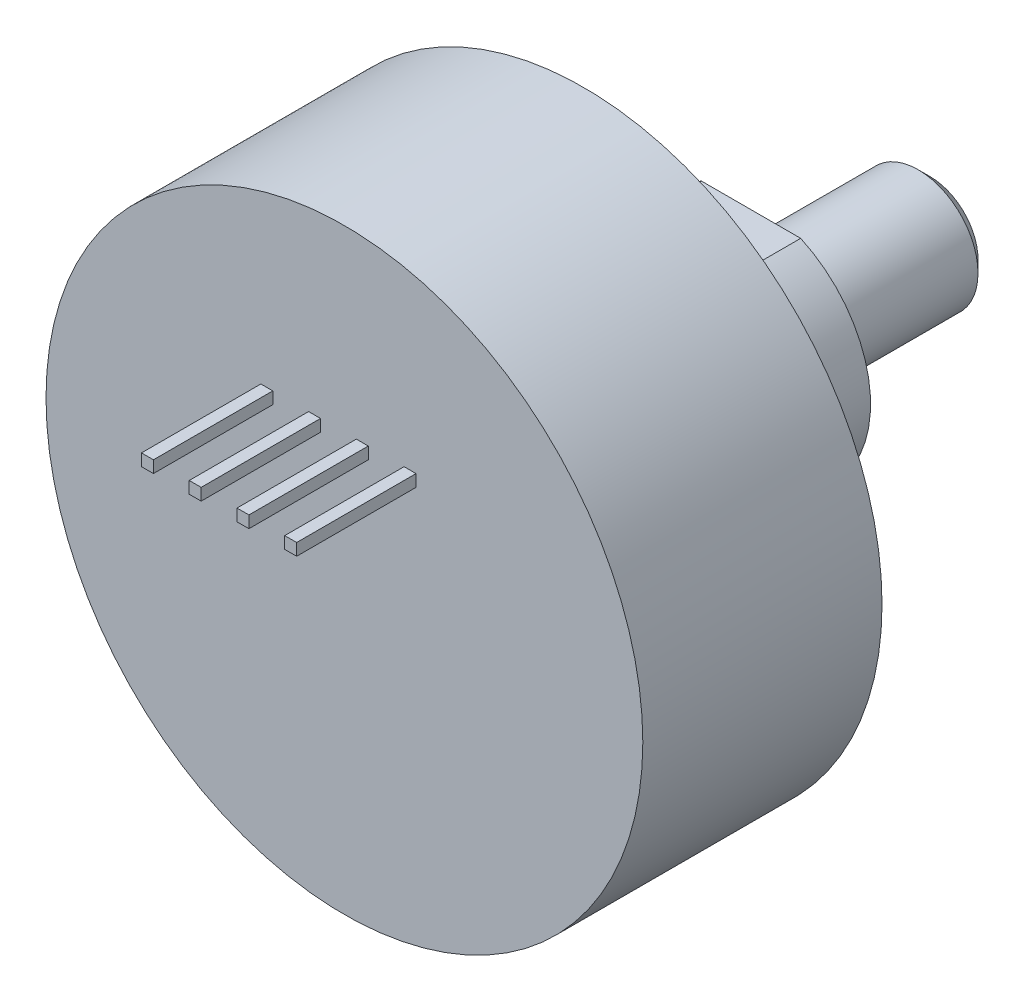
ISO-10303-21;
HEADER;
FILE_DESCRIPTION(('STEP AP214'),'2;1');
FILE_NAME('part.step','',(''),(''),'','','');
FILE_SCHEMA(('AUTOMOTIVE_DESIGN { 1 0 10303 214 1 1 1 1 }'));
ENDSEC;
DATA;
#1=APPLICATION_CONTEXT('core data for automotive mechanical design processes');
#2=APPLICATION_PROTOCOL_DEFINITION('international standard','automotive_design',2000,#1);
#3=PRODUCT_CONTEXT('',#1,'mechanical');
#4=PRODUCT('Part','Part','',(#3));
#5=PRODUCT_RELATED_PRODUCT_CATEGORY('part','',(#4));
#6=PRODUCT_DEFINITION_FORMATION('','',#4);
#7=PRODUCT_DEFINITION_CONTEXT('part definition',#1,'design');
#8=PRODUCT_DEFINITION('design','',#6,#7);
#9=PRODUCT_DEFINITION_SHAPE('','',#8);
#10=(LENGTH_UNIT() NAMED_UNIT(*) SI_UNIT(.MILLI.,.METRE.));
#11=(NAMED_UNIT(*) PLANE_ANGLE_UNIT() SI_UNIT($,.RADIAN.));
#12=(NAMED_UNIT(*) SI_UNIT($,.STERADIAN.) SOLID_ANGLE_UNIT());
#13=UNCERTAINTY_MEASURE_WITH_UNIT(LENGTH_MEASURE(1.E-05),#10,'distance_accuracy_value','');
#14=(GEOMETRIC_REPRESENTATION_CONTEXT(3) GLOBAL_UNCERTAINTY_ASSIGNED_CONTEXT((#13)) GLOBAL_UNIT_ASSIGNED_CONTEXT((#10,
#11,#12)) REPRESENTATION_CONTEXT('',''));
#15=CARTESIAN_POINT('',(0.,0.,0.));
#16=DIRECTION('',(0.,0.,1.));
#17=DIRECTION('',(1.,0.,0.));
#18=AXIS2_PLACEMENT_3D('',#15,#16,#17);
#19=CARTESIAN_POINT('',(-0.635,0.,-6.3881));
#20=DIRECTION('',(0.,0.,1.));
#21=DIRECTION('',(1.,0.,0.));
#22=AXIS2_PLACEMENT_3D('',#19,#20,#21);
#23=PLANE('',#22);
#24=CARTESIAN_POINT('',(0.,0.,-6.3881));
#25=DIRECTION('',(0.,0.,-1.));
#26=DIRECTION('',(-1.,0.,0.));
#27=AXIS2_PLACEMENT_3D('',#24,#25,#26);
#28=CIRCLE('',#27,6.985);
#29=CARTESIAN_POINT('',(-6.985,0.,-6.3881));
#30=VERTEX_POINT('',#29);
#31=EDGE_CURVE('E356',#30,#30,#28,.F.);
#32=ORIENTED_EDGE('',*,*,#31,.F.);
#33=EDGE_LOOP('',(#32));
#34=FACE_BOUND('',#33,.T.);
#35=CARTESIAN_POINT('',(0.,0.,-6.3881));
#36=DIRECTION('',(0.,0.,-1.));
#37=DIRECTION('',(-1.,0.,0.));
#38=AXIS2_PLACEMENT_3D('',#35,#36,#37);
#39=CIRCLE('',#38,6.35);
#40=CARTESIAN_POINT('',(2.63276238008674,5.7785,-6.3881));
#41=VERTEX_POINT('',#40);
#42=CARTESIAN_POINT('',(2.63276238008674,-5.7785,-6.3881));
#43=VERTEX_POINT('',#42);
#44=EDGE_CURVE('E216',#41,#43,#39,.T.);
#45=ORIENTED_EDGE('',*,*,#44,.F.);
#46=DIRECTION('',(1.,0.,0.));
#47=VECTOR('',#46,1.);
#48=CARTESIAN_POINT('',(2.63276238008674,5.7785,-6.3881));
#49=LINE('',#48,#47);
#50=CARTESIAN_POINT('',(-2.63276238008674,5.7785,-6.3881));
#51=VERTEX_POINT('',#50);
#52=EDGE_CURVE('E213',#51,#41,#49,.T.);
#53=ORIENTED_EDGE('',*,*,#52,.F.);
#54=CARTESIAN_POINT('',(0.,0.,-6.3881));
#55=DIRECTION('',(0.,0.,-1.));
#56=DIRECTION('',(1.,0.,0.));
#57=AXIS2_PLACEMENT_3D('',#54,#55,#56);
#58=CIRCLE('',#57,6.35);
#59=CARTESIAN_POINT('',(-2.63276238008674,-5.7785,-6.3881));
#60=VERTEX_POINT('',#59);
#61=EDGE_CURVE('E61',#60,#51,#58,.T.);
#62=ORIENTED_EDGE('',*,*,#61,.F.);
#63=DIRECTION('',(-1.,0.,0.));
#64=VECTOR('',#63,1.);
#65=CARTESIAN_POINT('',(2.63276238008674,-5.7785,-6.3881));
#66=LINE('',#65,#64);
#67=EDGE_CURVE('E56',#43,#60,#66,.T.);
#68=ORIENTED_EDGE('',*,*,#67,.F.);
#69=EDGE_LOOP('',(#45,#53,#62,#68));
#70=FACE_BOUND('',#69,.T.);
#71=ADVANCED_FACE('F34',(#34,#70),#23,.F.);
#72=CARTESIAN_POINT('',(0.,0.,-6.3627));
#73=DIRECTION('',(0.,0.,-1.));
#74=DIRECTION('',(-1.,0.,0.));
#75=AXIS2_PLACEMENT_3D('',#72,#73,#74);
#76=CYLINDRICAL_SURFACE('',#75,6.985);
#77=CARTESIAN_POINT('',(0.,0.,-6.3627));
#78=DIRECTION('',(0.,0.,-1.));
#79=DIRECTION('',(-1.,0.,0.));
#80=AXIS2_PLACEMENT_3D('',#77,#78,#79);
#81=CIRCLE('',#80,6.985);
#82=CARTESIAN_POINT('',(-6.985,0.,-6.3627));
#83=VERTEX_POINT('',#82);
#84=EDGE_CURVE('E347',#83,#83,#81,.T.);
#85=ORIENTED_EDGE('',*,*,#84,.T.);
#86=EDGE_LOOP('',(#85));
#87=FACE_BOUND('',#86,.T.);
#88=ORIENTED_EDGE('',*,*,#31,.T.);
#89=EDGE_LOOP('',(#88));
#90=FACE_BOUND('',#89,.T.);
#91=ADVANCED_FACE('F411',(#87,#90),#76,.T.);
#92=CARTESIAN_POINT('',(3.81,5.715,6.3627));
#93=DIRECTION('',(0.,-1.,0.));
#94=DIRECTION('',(0.,0.,-1.));
#95=AXIS2_PLACEMENT_3D('',#92,#93,#94);
#96=PLANE('',#95);
#97=DIRECTION('',(1.,0.,0.));
#98=VECTOR('',#97,1.);
#99=CARTESIAN_POINT('',(3.81,5.715,6.3627));
#100=LINE('',#99,#98);
#101=CARTESIAN_POINT('',(3.175,5.715,6.3627));
#102=VERTEX_POINT('',#101);
#103=CARTESIAN_POINT('',(3.81,5.715,6.3627));
#104=VERTEX_POINT('',#103);
#105=EDGE_CURVE('E354',#102,#104,#100,.T.);
#106=ORIENTED_EDGE('',*,*,#105,.T.);
#107=DIRECTION('',(0.,0.,-1.));
#108=VECTOR('',#107,1.);
#109=CARTESIAN_POINT('',(3.81,5.715,6.3627));
#110=LINE('',#109,#108);
#111=CARTESIAN_POINT('',(3.81,5.715,12.7127));
#112=VERTEX_POINT('',#111);
#113=EDGE_CURVE('E339',#112,#104,#110,.T.);
#114=ORIENTED_EDGE('',*,*,#113,.F.);
#115=DIRECTION('',(1.,0.,0.));
#116=VECTOR('',#115,1.);
#117=CARTESIAN_POINT('',(3.4925,5.715,12.7127));
#118=LINE('',#117,#116);
#119=CARTESIAN_POINT('',(3.175,5.715,12.7127));
#120=VERTEX_POINT('',#119);
#121=EDGE_CURVE('E345',#120,#112,#118,.T.);
#122=ORIENTED_EDGE('',*,*,#121,.F.);
#123=DIRECTION('',(0.,0.,1.));
#124=VECTOR('',#123,1.);
#125=CARTESIAN_POINT('',(3.175,5.715,6.3627));
#126=LINE('',#125,#124);
#127=EDGE_CURVE('E328',#102,#120,#126,.T.);
#128=ORIENTED_EDGE('',*,*,#127,.F.);
#129=EDGE_LOOP('',(#106,#114,#122,#128));
#130=FACE_BOUND('',#129,.T.);
#131=ADVANCED_FACE('F416',(#130),#96,.T.);
#132=CARTESIAN_POINT('',(1.27,5.715,6.3627));
#133=DIRECTION('',(0.,-1.,0.));
#134=DIRECTION('',(0.,0.,-1.));
#135=AXIS2_PLACEMENT_3D('',#132,#133,#134);
#136=PLANE('',#135);
#137=DIRECTION('',(1.,0.,0.));
#138=VECTOR('',#137,1.);
#139=CARTESIAN_POINT('',(1.27,5.715,6.3627));
#140=LINE('',#139,#138);
#141=CARTESIAN_POINT('',(0.635,5.715,6.3627));
#142=VERTEX_POINT('',#141);
#143=CARTESIAN_POINT('',(1.27,5.715,6.3627));
#144=VERTEX_POINT('',#143);
#145=EDGE_CURVE('E352',#142,#144,#140,.T.);
#146=ORIENTED_EDGE('',*,*,#145,.T.);
#147=DIRECTION('',(0.,0.,-1.));
#148=VECTOR('',#147,1.);
#149=CARTESIAN_POINT('',(1.27,5.715,6.3627));
#150=LINE('',#149,#148);
#151=CARTESIAN_POINT('',(1.27,5.715,12.7127));
#152=VERTEX_POINT('',#151);
#153=EDGE_CURVE('E320',#152,#144,#150,.T.);
#154=ORIENTED_EDGE('',*,*,#153,.F.);
#155=DIRECTION('',(1.,0.,0.));
#156=VECTOR('',#155,1.);
#157=CARTESIAN_POINT('',(0.9525,5.715,12.7127));
#158=LINE('',#157,#156);
#159=CARTESIAN_POINT('',(0.635,5.715,12.7127));
#160=VERTEX_POINT('',#159);
#161=EDGE_CURVE('E326',#160,#152,#158,.T.);
#162=ORIENTED_EDGE('',*,*,#161,.F.);
#163=DIRECTION('',(0.,0.,1.));
#164=VECTOR('',#163,1.);
#165=CARTESIAN_POINT('',(0.635,5.715,6.3627));
#166=LINE('',#165,#164);
#167=EDGE_CURVE('E309',#142,#160,#166,.T.);
#168=ORIENTED_EDGE('',*,*,#167,.F.);
#169=EDGE_LOOP('',(#146,#154,#162,#168));
#170=FACE_BOUND('',#169,.T.);
#171=ADVANCED_FACE('F420',(#170),#136,.T.);
#172=CARTESIAN_POINT('',(-1.27,5.715,6.3627));
#173=DIRECTION('',(0.,-1.,0.));
#174=DIRECTION('',(0.,0.,-1.));
#175=AXIS2_PLACEMENT_3D('',#172,#173,#174);
#176=PLANE('',#175);
#177=DIRECTION('',(1.,0.,0.));
#178=VECTOR('',#177,1.);
#179=CARTESIAN_POINT('',(-1.27,5.715,6.3627));
#180=LINE('',#179,#178);
#181=CARTESIAN_POINT('',(-1.905,5.715,6.3627));
#182=VERTEX_POINT('',#181);
#183=CARTESIAN_POINT('',(-1.27,5.715,6.3627));
#184=VERTEX_POINT('',#183);
#185=EDGE_CURVE('E350',#182,#184,#180,.T.);
#186=ORIENTED_EDGE('',*,*,#185,.T.);
#187=DIRECTION('',(0.,0.,-1.));
#188=VECTOR('',#187,1.);
#189=CARTESIAN_POINT('',(-1.27,5.715,6.3627));
#190=LINE('',#189,#188);
#191=CARTESIAN_POINT('',(-1.27,5.715,12.7127));
#192=VERTEX_POINT('',#191);
#193=EDGE_CURVE('E301',#192,#184,#190,.T.);
#194=ORIENTED_EDGE('',*,*,#193,.F.);
#195=DIRECTION('',(1.,0.,0.));
#196=VECTOR('',#195,1.);
#197=CARTESIAN_POINT('',(-1.5875,5.715,12.7127));
#198=LINE('',#197,#196);
#199=CARTESIAN_POINT('',(-1.905,5.715,12.7127));
#200=VERTEX_POINT('',#199);
#201=EDGE_CURVE('E307',#200,#192,#198,.T.);
#202=ORIENTED_EDGE('',*,*,#201,.F.);
#203=DIRECTION('',(0.,0.,1.));
#204=VECTOR('',#203,1.);
#205=CARTESIAN_POINT('',(-1.905,5.715,6.3627));
#206=LINE('',#205,#204);
#207=EDGE_CURVE('E290',#182,#200,#206,.T.);
#208=ORIENTED_EDGE('',*,*,#207,.F.);
#209=EDGE_LOOP('',(#186,#194,#202,#208));
#210=FACE_BOUND('',#209,.T.);
#211=ADVANCED_FACE('F424',(#210),#176,.T.);
#212=CARTESIAN_POINT('',(-3.81,5.715,6.3627));
#213=DIRECTION('',(0.,-1.,0.));
#214=DIRECTION('',(0.,0.,-1.));
#215=AXIS2_PLACEMENT_3D('',#212,#213,#214);
#216=PLANE('',#215);
#217=DIRECTION('',(1.,0.,0.));
#218=VECTOR('',#217,1.);
#219=CARTESIAN_POINT('',(-3.81,5.715,6.3627));
#220=LINE('',#219,#218);
#221=CARTESIAN_POINT('',(-4.445,5.715,6.3627));
#222=VERTEX_POINT('',#221);
#223=CARTESIAN_POINT('',(-3.81,5.715,6.3627));
#224=VERTEX_POINT('',#223);
#225=EDGE_CURVE('E348',#222,#224,#220,.T.);
#226=ORIENTED_EDGE('',*,*,#225,.T.);
#227=DIRECTION('',(0.,0.,-1.));
#228=VECTOR('',#227,1.);
#229=CARTESIAN_POINT('',(-3.81,5.715,6.3627));
#230=LINE('',#229,#228);
#231=CARTESIAN_POINT('',(-3.81,5.715,12.7127));
#232=VERTEX_POINT('',#231);
#233=EDGE_CURVE('E282',#232,#224,#230,.T.);
#234=ORIENTED_EDGE('',*,*,#233,.F.);
#235=DIRECTION('',(1.,0.,0.));
#236=VECTOR('',#235,1.);
#237=CARTESIAN_POINT('',(-4.1275,5.715,12.7127));
#238=LINE('',#237,#236);
#239=CARTESIAN_POINT('',(-4.445,5.715,12.7127));
#240=VERTEX_POINT('',#239);
#241=EDGE_CURVE('E288',#240,#232,#238,.T.);
#242=ORIENTED_EDGE('',*,*,#241,.F.);
#243=DIRECTION('',(0.,0.,1.));
#244=VECTOR('',#243,1.);
#245=CARTESIAN_POINT('',(-4.445,5.715,6.3627));
#246=LINE('',#245,#244);
#247=EDGE_CURVE('E271',#222,#240,#246,.T.);
#248=ORIENTED_EDGE('',*,*,#247,.F.);
#249=EDGE_LOOP('',(#226,#234,#242,#248));
#250=FACE_BOUND('',#249,.T.);
#251=ADVANCED_FACE('F428',(#250),#216,.T.);
#252=CARTESIAN_POINT('',(1.44318181818182,0.,-6.3627));
#253=DIRECTION('',(0.,0.,1.));
#254=DIRECTION('',(1.,0.,0.));
#255=AXIS2_PLACEMENT_3D('',#252,#253,#254);
#256=PLANE('',#255);
#257=ORIENTED_EDGE('',*,*,#84,.F.);
#258=EDGE_LOOP('',(#257));
#259=FACE_BOUND('',#258,.T.);
#260=CARTESIAN_POINT('',(0.,0.,-6.3627));
#261=DIRECTION('',(0.,0.,1.));
#262=DIRECTION('',(1.,0.,0.));
#263=AXIS2_PLACEMENT_3D('',#260,#261,#262);
#264=CIRCLE('',#263,15.875);
#265=CARTESIAN_POINT('',(15.875,0.,-6.3627));
#266=VERTEX_POINT('',#265);
#267=EDGE_CURVE('E270',#266,#266,#264,.T.);
#268=ORIENTED_EDGE('',*,*,#267,.F.);
#269=EDGE_LOOP('',(#268));
#270=FACE_BOUND('',#269,.T.);
#271=ADVANCED_FACE('F432',(#259,#270),#256,.F.);
#272=CARTESIAN_POINT('',(3.4925,6.0325,12.7127));
#273=DIRECTION('',(0.,0.,1.));
#274=DIRECTION('',(1.,0.,0.));
#275=AXIS2_PLACEMENT_3D('',#272,#273,#274);
#276=PLANE('',#275);
#277=DIRECTION('',(0.,1.,0.));
#278=VECTOR('',#277,1.);
#279=CARTESIAN_POINT('',(3.175,5.715,12.7127));
#280=LINE('',#279,#278);
#281=CARTESIAN_POINT('',(3.175,6.35,12.7127));
#282=VERTEX_POINT('',#281);
#283=EDGE_CURVE('E334',#120,#282,#280,.T.);
#284=ORIENTED_EDGE('',*,*,#283,.F.);
#285=ORIENTED_EDGE('',*,*,#121,.T.);
#286=DIRECTION('',(0.,1.,0.));
#287=VECTOR('',#286,1.);
#288=CARTESIAN_POINT('',(3.81,6.35,12.7127));
#289=LINE('',#288,#287);
#290=CARTESIAN_POINT('',(3.81,6.35,12.7127));
#291=VERTEX_POINT('',#290);
#292=EDGE_CURVE('E342',#291,#112,#289,.F.);
#293=ORIENTED_EDGE('',*,*,#292,.F.);
#294=DIRECTION('',(1.,0.,0.));
#295=VECTOR('',#294,1.);
#296=CARTESIAN_POINT('',(3.175,6.35,12.7127));
#297=LINE('',#296,#295);
#298=EDGE_CURVE('E267',#282,#291,#297,.T.);
#299=ORIENTED_EDGE('',*,*,#298,.F.);
#300=EDGE_LOOP('',(#284,#285,#293,#299));
#301=FACE_BOUND('',#300,.T.);
#302=ADVANCED_FACE('F436',(#301),#276,.T.);
#303=CARTESIAN_POINT('',(3.81,6.35,6.3627));
#304=DIRECTION('',(1.,0.,0.));
#305=DIRECTION('',(0.,0.,-1.));
#306=AXIS2_PLACEMENT_3D('',#303,#304,#305);
#307=PLANE('',#306);
#308=DIRECTION('',(0.,1.,0.));
#309=VECTOR('',#308,1.);
#310=CARTESIAN_POINT('',(3.81,6.35,6.3627));
#311=LINE('',#310,#309);
#312=CARTESIAN_POINT('',(3.81,6.35,6.3627));
#313=VERTEX_POINT('',#312);
#314=EDGE_CURVE('E337',#104,#313,#311,.T.);
#315=ORIENTED_EDGE('',*,*,#314,.T.);
#316=DIRECTION('',(0.,0.,1.));
#317=VECTOR('',#316,1.);
#318=CARTESIAN_POINT('',(3.81,6.35,6.3627));
#319=LINE('',#318,#317);
#320=EDGE_CURVE('E264',#291,#313,#319,.F.);
#321=ORIENTED_EDGE('',*,*,#320,.F.);
#322=ORIENTED_EDGE('',*,*,#292,.T.);
#323=ORIENTED_EDGE('',*,*,#113,.T.);
#324=EDGE_LOOP('',(#315,#321,#322,#323));
#325=FACE_BOUND('',#324,.T.);
#326=ADVANCED_FACE('F440',(#325),#307,.T.);
#327=CARTESIAN_POINT('',(3.175,5.715,6.3627));
#328=DIRECTION('',(-1.,0.,0.));
#329=DIRECTION('',(0.,0.,1.));
#330=AXIS2_PLACEMENT_3D('',#327,#328,#329);
#331=PLANE('',#330);
#332=DIRECTION('',(0.,1.,0.));
#333=VECTOR('',#332,1.);
#334=CARTESIAN_POINT('',(3.175,5.715,6.3627));
#335=LINE('',#334,#333);
#336=CARTESIAN_POINT('',(3.175,6.35,6.3627));
#337=VERTEX_POINT('',#336);
#338=EDGE_CURVE('E331',#337,#102,#335,.F.);
#339=ORIENTED_EDGE('',*,*,#338,.T.);
#340=ORIENTED_EDGE('',*,*,#127,.T.);
#341=ORIENTED_EDGE('',*,*,#283,.T.);
#342=DIRECTION('',(0.,0.,1.));
#343=VECTOR('',#342,1.);
#344=CARTESIAN_POINT('',(3.175,6.35,6.3627));
#345=LINE('',#344,#343);
#346=EDGE_CURVE('E261',#337,#282,#345,.T.);
#347=ORIENTED_EDGE('',*,*,#346,.F.);
#348=EDGE_LOOP('',(#339,#340,#341,#347));
#349=FACE_BOUND('',#348,.T.);
#350=ADVANCED_FACE('F444',(#349),#331,.T.);
#351=CARTESIAN_POINT('',(0.9525,6.0325,12.7127));
#352=DIRECTION('',(0.,0.,1.));
#353=DIRECTION('',(1.,0.,0.));
#354=AXIS2_PLACEMENT_3D('',#351,#352,#353);
#355=PLANE('',#354);
#356=DIRECTION('',(0.,1.,0.));
#357=VECTOR('',#356,1.);
#358=CARTESIAN_POINT('',(0.635,5.715,12.7127));
#359=LINE('',#358,#357);
#360=CARTESIAN_POINT('',(0.635,6.35,12.7127));
#361=VERTEX_POINT('',#360);
#362=EDGE_CURVE('E315',#160,#361,#359,.T.);
#363=ORIENTED_EDGE('',*,*,#362,.F.);
#364=ORIENTED_EDGE('',*,*,#161,.T.);
#365=DIRECTION('',(0.,1.,0.));
#366=VECTOR('',#365,1.);
#367=CARTESIAN_POINT('',(1.27,6.35,12.7127));
#368=LINE('',#367,#366);
#369=CARTESIAN_POINT('',(1.27,6.35,12.7127));
#370=VERTEX_POINT('',#369);
#371=EDGE_CURVE('E323',#370,#152,#368,.F.);
#372=ORIENTED_EDGE('',*,*,#371,.F.);
#373=DIRECTION('',(1.,0.,0.));
#374=VECTOR('',#373,1.);
#375=CARTESIAN_POINT('',(0.635,6.35,12.7127));
#376=LINE('',#375,#374);
#377=EDGE_CURVE('E258',#361,#370,#376,.T.);
#378=ORIENTED_EDGE('',*,*,#377,.F.);
#379=EDGE_LOOP('',(#363,#364,#372,#378));
#380=FACE_BOUND('',#379,.T.);
#381=ADVANCED_FACE('F448',(#380),#355,.T.);
#382=CARTESIAN_POINT('',(1.27,6.35,6.3627));
#383=DIRECTION('',(1.,0.,0.));
#384=DIRECTION('',(0.,0.,-1.));
#385=AXIS2_PLACEMENT_3D('',#382,#383,#384);
#386=PLANE('',#385);
#387=DIRECTION('',(0.,1.,0.));
#388=VECTOR('',#387,1.);
#389=CARTESIAN_POINT('',(1.27,6.35,6.3627));
#390=LINE('',#389,#388);
#391=CARTESIAN_POINT('',(1.27,6.35,6.3627));
#392=VERTEX_POINT('',#391);
#393=EDGE_CURVE('E318',#144,#392,#390,.T.);
#394=ORIENTED_EDGE('',*,*,#393,.T.);
#395=DIRECTION('',(0.,0.,1.));
#396=VECTOR('',#395,1.);
#397=CARTESIAN_POINT('',(1.27,6.35,6.3627));
#398=LINE('',#397,#396);
#399=EDGE_CURVE('E255',#370,#392,#398,.F.);
#400=ORIENTED_EDGE('',*,*,#399,.F.);
#401=ORIENTED_EDGE('',*,*,#371,.T.);
#402=ORIENTED_EDGE('',*,*,#153,.T.);
#403=EDGE_LOOP('',(#394,#400,#401,#402));
#404=FACE_BOUND('',#403,.T.);
#405=ADVANCED_FACE('F452',(#404),#386,.T.);
#406=CARTESIAN_POINT('',(0.635,5.715,6.3627));
#407=DIRECTION('',(-1.,0.,0.));
#408=DIRECTION('',(0.,0.,1.));
#409=AXIS2_PLACEMENT_3D('',#406,#407,#408);
#410=PLANE('',#409);
#411=DIRECTION('',(0.,1.,0.));
#412=VECTOR('',#411,1.);
#413=CARTESIAN_POINT('',(0.635,5.715,6.3627));
#414=LINE('',#413,#412);
#415=CARTESIAN_POINT('',(0.635,6.35,6.3627));
#416=VERTEX_POINT('',#415);
#417=EDGE_CURVE('E312',#416,#142,#414,.F.);
#418=ORIENTED_EDGE('',*,*,#417,.T.);
#419=ORIENTED_EDGE('',*,*,#167,.T.);
#420=ORIENTED_EDGE('',*,*,#362,.T.);
#421=DIRECTION('',(0.,0.,1.));
#422=VECTOR('',#421,1.);
#423=CARTESIAN_POINT('',(0.635,6.35,6.3627));
#424=LINE('',#423,#422);
#425=EDGE_CURVE('E252',#416,#361,#424,.T.);
#426=ORIENTED_EDGE('',*,*,#425,.F.);
#427=EDGE_LOOP('',(#418,#419,#420,#426));
#428=FACE_BOUND('',#427,.T.);
#429=ADVANCED_FACE('F456',(#428),#410,.T.);
#430=CARTESIAN_POINT('',(-1.5875,6.0325,12.7127));
#431=DIRECTION('',(0.,0.,1.));
#432=DIRECTION('',(1.,0.,0.));
#433=AXIS2_PLACEMENT_3D('',#430,#431,#432);
#434=PLANE('',#433);
#435=DIRECTION('',(0.,1.,0.));
#436=VECTOR('',#435,1.);
#437=CARTESIAN_POINT('',(-1.905,5.715,12.7127));
#438=LINE('',#437,#436);
#439=CARTESIAN_POINT('',(-1.905,6.35,12.7127));
#440=VERTEX_POINT('',#439);
#441=EDGE_CURVE('E296',#200,#440,#438,.T.);
#442=ORIENTED_EDGE('',*,*,#441,.F.);
#443=ORIENTED_EDGE('',*,*,#201,.T.);
#444=DIRECTION('',(0.,1.,0.));
#445=VECTOR('',#444,1.);
#446=CARTESIAN_POINT('',(-1.27,6.35,12.7127));
#447=LINE('',#446,#445);
#448=CARTESIAN_POINT('',(-1.27,6.35,12.7127));
#449=VERTEX_POINT('',#448);
#450=EDGE_CURVE('E304',#449,#192,#447,.F.);
#451=ORIENTED_EDGE('',*,*,#450,.F.);
#452=DIRECTION('',(1.,0.,0.));
#453=VECTOR('',#452,1.);
#454=CARTESIAN_POINT('',(-1.905,6.35,12.7127));
#455=LINE('',#454,#453);
#456=EDGE_CURVE('E249',#440,#449,#455,.T.);
#457=ORIENTED_EDGE('',*,*,#456,.F.);
#458=EDGE_LOOP('',(#442,#443,#451,#457));
#459=FACE_BOUND('',#458,.T.);
#460=ADVANCED_FACE('F460',(#459),#434,.T.);
#461=CARTESIAN_POINT('',(-1.27,6.35,6.3627));
#462=DIRECTION('',(1.,0.,0.));
#463=DIRECTION('',(0.,0.,-1.));
#464=AXIS2_PLACEMENT_3D('',#461,#462,#463);
#465=PLANE('',#464);
#466=DIRECTION('',(0.,1.,0.));
#467=VECTOR('',#466,1.);
#468=CARTESIAN_POINT('',(-1.27,6.35,6.3627));
#469=LINE('',#468,#467);
#470=CARTESIAN_POINT('',(-1.27,6.35,6.3627));
#471=VERTEX_POINT('',#470);
#472=EDGE_CURVE('E299',#184,#471,#469,.T.);
#473=ORIENTED_EDGE('',*,*,#472,.T.);
#474=DIRECTION('',(0.,0.,1.));
#475=VECTOR('',#474,1.);
#476=CARTESIAN_POINT('',(-1.27,6.35,6.3627));
#477=LINE('',#476,#475);
#478=EDGE_CURVE('E246',#449,#471,#477,.F.);
#479=ORIENTED_EDGE('',*,*,#478,.F.);
#480=ORIENTED_EDGE('',*,*,#450,.T.);
#481=ORIENTED_EDGE('',*,*,#193,.T.);
#482=EDGE_LOOP('',(#473,#479,#480,#481));
#483=FACE_BOUND('',#482,.T.);
#484=ADVANCED_FACE('F464',(#483),#465,.T.);
#485=CARTESIAN_POINT('',(-1.905,5.715,6.3627));
#486=DIRECTION('',(-1.,0.,0.));
#487=DIRECTION('',(0.,0.,1.));
#488=AXIS2_PLACEMENT_3D('',#485,#486,#487);
#489=PLANE('',#488);
#490=DIRECTION('',(0.,1.,0.));
#491=VECTOR('',#490,1.);
#492=CARTESIAN_POINT('',(-1.905,5.715,6.3627));
#493=LINE('',#492,#491);
#494=CARTESIAN_POINT('',(-1.905,6.35,6.3627));
#495=VERTEX_POINT('',#494);
#496=EDGE_CURVE('E293',#495,#182,#493,.F.);
#497=ORIENTED_EDGE('',*,*,#496,.T.);
#498=ORIENTED_EDGE('',*,*,#207,.T.);
#499=ORIENTED_EDGE('',*,*,#441,.T.);
#500=DIRECTION('',(0.,0.,1.));
#501=VECTOR('',#500,1.);
#502=CARTESIAN_POINT('',(-1.905,6.35,6.3627));
#503=LINE('',#502,#501);
#504=EDGE_CURVE('E243',#495,#440,#503,.T.);
#505=ORIENTED_EDGE('',*,*,#504,.F.);
#506=EDGE_LOOP('',(#497,#498,#499,#505));
#507=FACE_BOUND('',#506,.T.);
#508=ADVANCED_FACE('F468',(#507),#489,.T.);
#509=CARTESIAN_POINT('',(-4.1275,6.0325,12.7127));
#510=DIRECTION('',(0.,0.,1.));
#511=DIRECTION('',(1.,0.,0.));
#512=AXIS2_PLACEMENT_3D('',#509,#510,#511);
#513=PLANE('',#512);
#514=DIRECTION('',(0.,1.,0.));
#515=VECTOR('',#514,1.);
#516=CARTESIAN_POINT('',(-4.445,5.715,12.7127));
#517=LINE('',#516,#515);
#518=CARTESIAN_POINT('',(-4.445,6.35,12.7127));
#519=VERTEX_POINT('',#518);
#520=EDGE_CURVE('E277',#240,#519,#517,.T.);
#521=ORIENTED_EDGE('',*,*,#520,.F.);
#522=ORIENTED_EDGE('',*,*,#241,.T.);
#523=DIRECTION('',(0.,1.,0.));
#524=VECTOR('',#523,1.);
#525=CARTESIAN_POINT('',(-3.81,6.35,12.7127));
#526=LINE('',#525,#524);
#527=CARTESIAN_POINT('',(-3.81,6.35,12.7127));
#528=VERTEX_POINT('',#527);
#529=EDGE_CURVE('E285',#528,#232,#526,.F.);
#530=ORIENTED_EDGE('',*,*,#529,.F.);
#531=DIRECTION('',(1.,0.,0.));
#532=VECTOR('',#531,1.);
#533=CARTESIAN_POINT('',(-4.445,6.35,12.7127));
#534=LINE('',#533,#532);
#535=EDGE_CURVE('E240',#519,#528,#534,.T.);
#536=ORIENTED_EDGE('',*,*,#535,.F.);
#537=EDGE_LOOP('',(#521,#522,#530,#536));
#538=FACE_BOUND('',#537,.T.);
#539=ADVANCED_FACE('F472',(#538),#513,.T.);
#540=CARTESIAN_POINT('',(-3.81,6.35,6.3627));
#541=DIRECTION('',(1.,0.,0.));
#542=DIRECTION('',(0.,0.,-1.));
#543=AXIS2_PLACEMENT_3D('',#540,#541,#542);
#544=PLANE('',#543);
#545=DIRECTION('',(0.,1.,0.));
#546=VECTOR('',#545,1.);
#547=CARTESIAN_POINT('',(-3.81,6.35,6.3627));
#548=LINE('',#547,#546);
#549=CARTESIAN_POINT('',(-3.81,6.35,6.3627));
#550=VERTEX_POINT('',#549);
#551=EDGE_CURVE('E280',#224,#550,#548,.T.);
#552=ORIENTED_EDGE('',*,*,#551,.T.);
#553=DIRECTION('',(0.,0.,1.));
#554=VECTOR('',#553,1.);
#555=CARTESIAN_POINT('',(-3.81,6.35,6.3627));
#556=LINE('',#555,#554);
#557=EDGE_CURVE('E237',#528,#550,#556,.F.);
#558=ORIENTED_EDGE('',*,*,#557,.F.);
#559=ORIENTED_EDGE('',*,*,#529,.T.);
#560=ORIENTED_EDGE('',*,*,#233,.T.);
#561=EDGE_LOOP('',(#552,#558,#559,#560));
#562=FACE_BOUND('',#561,.T.);
#563=ADVANCED_FACE('F476',(#562),#544,.T.);
#564=CARTESIAN_POINT('',(-4.445,5.715,6.3627));
#565=DIRECTION('',(-1.,0.,0.));
#566=DIRECTION('',(0.,0.,1.));
#567=AXIS2_PLACEMENT_3D('',#564,#565,#566);
#568=PLANE('',#567);
#569=DIRECTION('',(0.,1.,0.));
#570=VECTOR('',#569,1.);
#571=CARTESIAN_POINT('',(-4.445,5.715,6.3627));
#572=LINE('',#571,#570);
#573=CARTESIAN_POINT('',(-4.445,6.35,6.3627));
#574=VERTEX_POINT('',#573);
#575=EDGE_CURVE('E274',#574,#222,#572,.F.);
#576=ORIENTED_EDGE('',*,*,#575,.T.);
#577=ORIENTED_EDGE('',*,*,#247,.T.);
#578=ORIENTED_EDGE('',*,*,#520,.T.);
#579=DIRECTION('',(0.,0.,1.));
#580=VECTOR('',#579,1.);
#581=CARTESIAN_POINT('',(-4.445,6.35,6.3627));
#582=LINE('',#581,#580);
#583=EDGE_CURVE('E234',#574,#519,#582,.T.);
#584=ORIENTED_EDGE('',*,*,#583,.F.);
#585=EDGE_LOOP('',(#576,#577,#578,#584));
#586=FACE_BOUND('',#585,.T.);
#587=ADVANCED_FACE('F480',(#586),#568,.T.);
#588=CARTESIAN_POINT('',(0.,0.,0.));
#589=DIRECTION('',(0.,0.,1.));
#590=DIRECTION('',(1.,0.,0.));
#591=AXIS2_PLACEMENT_3D('',#588,#589,#590);
#592=CYLINDRICAL_SURFACE('',#591,15.875);
#593=CARTESIAN_POINT('',(0.,0.,6.3627));
#594=DIRECTION('',(0.,0.,1.));
#595=DIRECTION('',(1.,0.,0.));
#596=AXIS2_PLACEMENT_3D('',#593,#594,#595);
#597=CIRCLE('',#596,15.875);
#598=CARTESIAN_POINT('',(15.875,0.,6.3627));
#599=VERTEX_POINT('',#598);
#600=EDGE_CURVE('E233',#599,#599,#597,.T.);
#601=ORIENTED_EDGE('',*,*,#600,.F.);
#602=EDGE_LOOP('',(#601));
#603=FACE_BOUND('',#602,.T.);
#604=ORIENTED_EDGE('',*,*,#267,.T.);
#605=EDGE_LOOP('',(#604));
#606=FACE_BOUND('',#605,.T.);
#607=ADVANCED_FACE('F484',(#603,#606),#592,.T.);
#608=CARTESIAN_POINT('',(3.175,6.35,6.3627));
#609=DIRECTION('',(0.,1.,0.));
#610=DIRECTION('',(0.,0.,1.));
#611=AXIS2_PLACEMENT_3D('',#608,#609,#610);
#612=PLANE('',#611);
#613=DIRECTION('',(1.,0.,0.));
#614=VECTOR('',#613,1.);
#615=CARTESIAN_POINT('',(1.44318181818182,6.35,6.3627));
#616=LINE('',#615,#614);
#617=EDGE_CURVE('E230',#337,#313,#616,.T.);
#618=ORIENTED_EDGE('',*,*,#617,.F.);
#619=ORIENTED_EDGE('',*,*,#346,.T.);
#620=ORIENTED_EDGE('',*,*,#298,.T.);
#621=ORIENTED_EDGE('',*,*,#320,.T.);
#622=EDGE_LOOP('',(#618,#619,#620,#621));
#623=FACE_BOUND('',#622,.T.);
#624=ADVANCED_FACE('F488',(#623),#612,.T.);
#625=CARTESIAN_POINT('',(0.635,6.35,6.3627));
#626=DIRECTION('',(0.,1.,0.));
#627=DIRECTION('',(0.,0.,1.));
#628=AXIS2_PLACEMENT_3D('',#625,#626,#627);
#629=PLANE('',#628);
#630=DIRECTION('',(1.,0.,0.));
#631=VECTOR('',#630,1.);
#632=CARTESIAN_POINT('',(1.44318181818182,6.35,6.3627));
#633=LINE('',#632,#631);
#634=EDGE_CURVE('E227',#416,#392,#633,.T.);
#635=ORIENTED_EDGE('',*,*,#634,.F.);
#636=ORIENTED_EDGE('',*,*,#425,.T.);
#637=ORIENTED_EDGE('',*,*,#377,.T.);
#638=ORIENTED_EDGE('',*,*,#399,.T.);
#639=EDGE_LOOP('',(#635,#636,#637,#638));
#640=FACE_BOUND('',#639,.T.);
#641=ADVANCED_FACE('F492',(#640),#629,.T.);
#642=CARTESIAN_POINT('',(-1.905,6.35,6.3627));
#643=DIRECTION('',(0.,1.,0.));
#644=DIRECTION('',(0.,0.,1.));
#645=AXIS2_PLACEMENT_3D('',#642,#643,#644);
#646=PLANE('',#645);
#647=DIRECTION('',(1.,0.,0.));
#648=VECTOR('',#647,1.);
#649=CARTESIAN_POINT('',(1.44318181818182,6.35,6.3627));
#650=LINE('',#649,#648);
#651=EDGE_CURVE('E48',#495,#471,#650,.T.);
#652=ORIENTED_EDGE('',*,*,#651,.F.);
#653=ORIENTED_EDGE('',*,*,#504,.T.);
#654=ORIENTED_EDGE('',*,*,#456,.T.);
#655=ORIENTED_EDGE('',*,*,#478,.T.);
#656=EDGE_LOOP('',(#652,#653,#654,#655));
#657=FACE_BOUND('',#656,.T.);
#658=ADVANCED_FACE('F496',(#657),#646,.T.);
#659=CARTESIAN_POINT('',(-4.445,6.35,6.3627));
#660=DIRECTION('',(0.,1.,0.));
#661=DIRECTION('',(0.,0.,1.));
#662=AXIS2_PLACEMENT_3D('',#659,#660,#661);
#663=PLANE('',#662);
#664=DIRECTION('',(1.,0.,0.));
#665=VECTOR('',#664,1.);
#666=CARTESIAN_POINT('',(1.44318181818182,6.35,6.3627));
#667=LINE('',#666,#665);
#668=EDGE_CURVE('E11',#574,#550,#667,.T.);
#669=ORIENTED_EDGE('',*,*,#668,.F.);
#670=ORIENTED_EDGE('',*,*,#583,.T.);
#671=ORIENTED_EDGE('',*,*,#535,.T.);
#672=ORIENTED_EDGE('',*,*,#557,.T.);
#673=EDGE_LOOP('',(#669,#670,#671,#672));
#674=FACE_BOUND('',#673,.T.);
#675=ADVANCED_FACE('F500',(#674),#663,.T.);
#676=CARTESIAN_POINT('',(1.44318181818182,0.,6.3627));
#677=DIRECTION('',(0.,0.,1.));
#678=DIRECTION('',(1.,0.,0.));
#679=AXIS2_PLACEMENT_3D('',#676,#677,#678);
#680=PLANE('',#679);
#681=ORIENTED_EDGE('',*,*,#575,.F.);
#682=ORIENTED_EDGE('',*,*,#668,.T.);
#683=ORIENTED_EDGE('',*,*,#551,.F.);
#684=ORIENTED_EDGE('',*,*,#225,.F.);
#685=EDGE_LOOP('',(#681,#682,#683,#684));
#686=FACE_BOUND('',#685,.T.);
#687=ORIENTED_EDGE('',*,*,#496,.F.);
#688=ORIENTED_EDGE('',*,*,#651,.T.);
#689=ORIENTED_EDGE('',*,*,#472,.F.);
#690=ORIENTED_EDGE('',*,*,#185,.F.);
#691=EDGE_LOOP('',(#687,#688,#689,#690));
#692=FACE_BOUND('',#691,.T.);
#693=ORIENTED_EDGE('',*,*,#417,.F.);
#694=ORIENTED_EDGE('',*,*,#634,.T.);
#695=ORIENTED_EDGE('',*,*,#393,.F.);
#696=ORIENTED_EDGE('',*,*,#145,.F.);
#697=EDGE_LOOP('',(#693,#694,#695,#696));
#698=FACE_BOUND('',#697,.T.);
#699=ORIENTED_EDGE('',*,*,#338,.F.);
#700=ORIENTED_EDGE('',*,*,#617,.T.);
#701=ORIENTED_EDGE('',*,*,#314,.F.);
#702=ORIENTED_EDGE('',*,*,#105,.F.);
#703=EDGE_LOOP('',(#699,#700,#701,#702));
#704=FACE_BOUND('',#703,.T.);
#705=ORIENTED_EDGE('',*,*,#600,.T.);
#706=EDGE_LOOP('',(#705));
#707=FACE_BOUND('',#706,.T.);
#708=ADVANCED_FACE('F413',(#686,#692,#698,#704,#707),#680,.T.);
#709=CARTESIAN_POINT('',(0.,0.,-15.2781));
#710=DIRECTION('',(0.,0.,1.));
#711=DIRECTION('',(1.,0.,0.));
#712=AXIS2_PLACEMENT_3D('',#709,#710,#711);
#713=CYLINDRICAL_SURFACE('',#712,6.35);
#714=ORIENTED_EDGE('',*,*,#44,.T.);
#715=DIRECTION('',(0.,0.,1.));
#716=VECTOR('',#715,1.);
#717=CARTESIAN_POINT('',(2.63276238008674,-5.7785,-15.2781));
#718=LINE('',#717,#716);
#719=CARTESIAN_POINT('',(2.63276238008674,-5.7785,-15.2781));
#720=VERTEX_POINT('',#719);
#721=EDGE_CURVE('E197',#720,#43,#718,.T.);
#722=ORIENTED_EDGE('',*,*,#721,.F.);
#723=CARTESIAN_POINT('',(0.,0.,-15.2781));
#724=DIRECTION('',(0.,0.,-1.));
#725=DIRECTION('',(-1.,0.,0.));
#726=AXIS2_PLACEMENT_3D('',#723,#724,#725);
#727=CIRCLE('',#726,6.35);
#728=CARTESIAN_POINT('',(2.63276238008674,5.7785,-15.2781));
#729=VERTEX_POINT('',#728);
#730=EDGE_CURVE('E204',#729,#720,#727,.T.);
#731=ORIENTED_EDGE('',*,*,#730,.F.);
#732=DIRECTION('',(0.,0.,1.));
#733=VECTOR('',#732,1.);
#734=CARTESIAN_POINT('',(2.63276238008674,5.7785,-15.2781));
#735=LINE('',#734,#733);
#736=EDGE_CURVE('E763',#729,#41,#735,.T.);
#737=ORIENTED_EDGE('',*,*,#736,.T.);
#738=EDGE_LOOP('',(#714,#722,#731,#737));
#739=FACE_BOUND('',#738,.T.);
#740=ADVANCED_FACE('F215',(#739),#713,.T.);
#741=CARTESIAN_POINT('',(2.63276238008674,-5.7785,-15.2781));
#742=DIRECTION('',(0.,1.,0.));
#743=DIRECTION('',(0.,0.,1.));
#744=AXIS2_PLACEMENT_3D('',#741,#742,#743);
#745=PLANE('',#744);
#746=ORIENTED_EDGE('',*,*,#67,.T.);
#747=DIRECTION('',(0.,0.,1.));
#748=VECTOR('',#747,1.);
#749=CARTESIAN_POINT('',(-2.63276238008674,-5.7785,-15.2781));
#750=LINE('',#749,#748);
#751=CARTESIAN_POINT('',(-2.63276238008674,-5.7785,-15.2781));
#752=VERTEX_POINT('',#751);
#753=EDGE_CURVE('E200',#752,#60,#750,.T.);
#754=ORIENTED_EDGE('',*,*,#753,.F.);
#755=DIRECTION('',(-1.,0.,0.));
#756=VECTOR('',#755,1.);
#757=CARTESIAN_POINT('',(2.63276238008674,-5.7785,-15.2781));
#758=LINE('',#757,#756);
#759=EDGE_CURVE('E193',#720,#752,#758,.T.);
#760=ORIENTED_EDGE('',*,*,#759,.F.);
#761=ORIENTED_EDGE('',*,*,#721,.T.);
#762=EDGE_LOOP('',(#746,#754,#760,#761));
#763=FACE_BOUND('',#762,.T.);
#764=ADVANCED_FACE('F195',(#763),#745,.F.);
#765=CARTESIAN_POINT('',(0.,0.,-15.2781));
#766=DIRECTION('',(0.,0.,1.));
#767=DIRECTION('',(1.,0.,0.));
#768=AXIS2_PLACEMENT_3D('',#765,#766,#767);
#769=CYLINDRICAL_SURFACE('',#768,6.35);
#770=ORIENTED_EDGE('',*,*,#61,.T.);
#771=DIRECTION('',(0.,0.,1.));
#772=VECTOR('',#771,1.);
#773=CARTESIAN_POINT('',(-2.63276238008674,5.7785,-15.2781));
#774=LINE('',#773,#772);
#775=CARTESIAN_POINT('',(-2.63276238008674,5.7785,-15.2781));
#776=VERTEX_POINT('',#775);
#777=EDGE_CURVE('E221',#776,#51,#774,.T.);
#778=ORIENTED_EDGE('',*,*,#777,.F.);
#779=CARTESIAN_POINT('',(0.,0.,-15.2781));
#780=DIRECTION('',(0.,0.,-1.));
#781=DIRECTION('',(1.,0.,0.));
#782=AXIS2_PLACEMENT_3D('',#779,#780,#781);
#783=CIRCLE('',#782,6.35);
#784=EDGE_CURVE('E203',#752,#776,#783,.T.);
#785=ORIENTED_EDGE('',*,*,#784,.F.);
#786=ORIENTED_EDGE('',*,*,#753,.T.);
#787=EDGE_LOOP('',(#770,#778,#785,#786));
#788=FACE_BOUND('',#787,.T.);
#789=ADVANCED_FACE('F512',(#788),#769,.T.);
#790=CARTESIAN_POINT('',(2.63276238008674,5.7785,-15.2781));
#791=DIRECTION('',(0.,-1.,0.));
#792=DIRECTION('',(0.,0.,-1.));
#793=AXIS2_PLACEMENT_3D('',#790,#791,#792);
#794=PLANE('',#793);
#795=ORIENTED_EDGE('',*,*,#52,.T.);
#796=ORIENTED_EDGE('',*,*,#736,.F.);
#797=DIRECTION('',(1.,0.,0.));
#798=VECTOR('',#797,1.);
#799=CARTESIAN_POINT('',(2.63276238008674,5.7785,-15.2781));
#800=LINE('',#799,#798);
#801=EDGE_CURVE('E209',#776,#729,#800,.T.);
#802=ORIENTED_EDGE('',*,*,#801,.F.);
#803=ORIENTED_EDGE('',*,*,#777,.T.);
#804=EDGE_LOOP('',(#795,#796,#802,#803));
#805=FACE_BOUND('',#804,.T.);
#806=ADVANCED_FACE('F515',(#805),#794,.F.);
#807=CARTESIAN_POINT('',(0.,0.,-15.2781));
#808=DIRECTION('',(0.,0.,-1.));
#809=DIRECTION('',(-1.,0.,0.));
#810=AXIS2_PLACEMENT_3D('',#807,#808,#809);
#811=PLANE('',#810);
#812=CARTESIAN_POINT('',(0.,0.,-15.2781));
#813=DIRECTION('',(0.,0.,-1.));
#814=DIRECTION('',(0.,1.,0.));
#815=AXIS2_PLACEMENT_3D('',#812,#813,#814);
#816=CIRCLE('',#815,4.7625);
#817=CARTESIAN_POINT('',(0.,4.7625,-15.2781));
#818=VERTEX_POINT('',#817);
#819=EDGE_CURVE('E357',#818,#818,#816,.F.);
#820=ORIENTED_EDGE('',*,*,#819,.T.);
#821=EDGE_LOOP('',(#820));
#822=FACE_BOUND('',#821,.T.);
#823=ORIENTED_EDGE('',*,*,#730,.T.);
#824=ORIENTED_EDGE('',*,*,#759,.T.);
#825=ORIENTED_EDGE('',*,*,#784,.T.);
#826=ORIENTED_EDGE('',*,*,#801,.T.);
#827=EDGE_LOOP('',(#823,#824,#825,#826));
#828=FACE_BOUND('',#827,.T.);
#829=ADVANCED_FACE('F207',(#822,#828),#811,.T.);
#830=CARTESIAN_POINT('',(-0.288636363636354,0.,-24.8031));
#831=DIRECTION('',(0.,0.,1.));
#832=DIRECTION('',(1.,0.,0.));
#833=AXIS2_PLACEMENT_3D('',#830,#831,#832);
#834=PLANE('',#833);
#835=DIRECTION('',(1.,0.,0.));
#836=VECTOR('',#835,1.);
#837=CARTESIAN_POINT('',(-2.06350575477754,-2.413,-24.8031));
#838=LINE('',#837,#836);
#839=CARTESIAN_POINT('',(0.793114747172143,-2.413,-24.8031000001349));
#840=VERTEX_POINT('',#839);
#841=CARTESIAN_POINT('',(-0.793114747172143,-2.413,-24.8031000001349));
#842=VERTEX_POINT('',#841);
#843=EDGE_CURVE('E217',#840,#842,#838,.F.);
#844=ORIENTED_EDGE('',*,*,#843,.T.);
#845=CARTESIAN_POINT('',(0.,0.,-24.8031000002698));
#846=DIRECTION('',(0.,0.,1.));
#847=DIRECTION('',(1.,0.,0.));
#848=AXIS2_PLACEMENT_3D('',#845,#846,#847);
#849=CIRCLE('',#848,2.54000000029464);
#850=EDGE_CURVE('E377',#840,#842,#849,.T.);
#851=ORIENTED_EDGE('',*,*,#850,.F.);
#852=EDGE_LOOP('',(#844,#851));
#853=FACE_BOUND('',#852,.T.);
#854=ADVANCED_FACE('F36',(#853),#834,.F.);
#855=CARTESIAN_POINT('',(0.,-2.64934966757468,-18.4531));
#856=DIRECTION('',(0.,0.,1.));
#857=DIRECTION('',(1.,0.,0.));
#858=AXIS2_PLACEMENT_3D('',#855,#856,#857);
#859=PLANE('',#858);
#860=CARTESIAN_POINT('',(0.,0.,-18.4531));
#861=DIRECTION('',(0.,0.,-1.));
#862=DIRECTION('',(0.,1.,0.));
#863=AXIS2_PLACEMENT_3D('',#860,#861,#862);
#864=CIRCLE('',#863,3.175);
#865=CARTESIAN_POINT('',(-2.06350575477754,-2.413,-18.4531));
#866=VERTEX_POINT('',#865);
#867=CARTESIAN_POINT('',(2.06350575477754,-2.413,-18.4531));
#868=VERTEX_POINT('',#867);
#869=EDGE_CURVE('E370',#866,#868,#864,.F.);
#870=ORIENTED_EDGE('',*,*,#869,.F.);
#871=DIRECTION('',(1.,0.,0.));
#872=VECTOR('',#871,1.);
#873=CARTESIAN_POINT('',(-2.06350575477754,-2.413,-18.4531));
#874=LINE('',#873,#872);
#875=EDGE_CURVE('E371',#866,#868,#874,.T.);
#876=ORIENTED_EDGE('',*,*,#875,.T.);
#877=EDGE_LOOP('',(#870,#876));
#878=FACE_BOUND('',#877,.T.);
#879=ADVANCED_FACE('F398',(#878),#859,.F.);
#880=CARTESIAN_POINT('',(0.,0.,-24.1680999997698));
#881=DIRECTION('',(0.,0.,1.));
#882=DIRECTION('',(1.,0.,0.));
#883=AXIS2_PLACEMENT_3D('',#880,#881,#882);
#884=CONICAL_SURFACE('',#883,3.17499999965776,0.785398162502276);
#885=CARTESIAN_POINT('',(2.06350575454893,-2.41300000010911,-24.1680999996475));
#886=CARTESIAN_POINT('',(2.01367238508041,-2.41300000004021,-24.2004840891326));
#887=CARTESIAN_POINT('',(1.9635324564367,-2.41300000001101,-24.2323978738531));
#888=CARTESIAN_POINT('',(1.8625599241999,-2.41299999998899,-24.2951286559188));
#889=CARTESIAN_POINT('',(1.81172720302655,-2.41299999999617,-24.3259454637978));
#890=CARTESIAN_POINT('',(1.65857137727744,-2.41300000000763,-24.4162195601059));
#891=CARTESIAN_POINT('',(1.55512952737587,-2.41300000000201,-24.4738039357255));
#892=CARTESIAN_POINT('',(1.34451388102553,-2.41299999999799,-24.5822799128966));
#893=CARTESIAN_POINT('',(1.23733433218585,-2.4129999999996,-24.6331605653507));
#894=CARTESIAN_POINT('',(1.07336102124294,-2.4130000000002,-24.7026048334243));
#895=CARTESIAN_POINT('',(1.01804132219534,-2.4130000000001,-24.7246485387159));
#896=CARTESIAN_POINT('',(0.906357231275285,-2.4129999999999,-24.7660162836704));
#897=CARTESIAN_POINT('',(0.849992195273784,-2.4129999999998,-24.7853385788398));
#898=CARTESIAN_POINT('',(0.793114745967575,-2.413,-24.803100000511));
#899=B_SPLINE_CURVE_WITH_KNOTS('',3,(#885,#886,#887,#888,#889,#890,#891,#892,#893,#894,#895,
#896,#897,#898),.UNSPECIFIED.,.F.,.F.,(4,2,2,2,2,2,4),(0.,0.178291108981934,0.356612863846152,
0.71160214105114,1.06716421370313,1.2457496052904,1.42444895866241),.UNSPECIFIED.);
#900=CARTESIAN_POINT('',(2.06350575464693,-2.413,-24.1680999997986));
#901=VERTEX_POINT('',#900);
#902=EDGE_CURVE('E373',#901,#840,#899,.T.);
#903=ORIENTED_EDGE('',*,*,#902,.T.);
#904=ORIENTED_EDGE('',*,*,#850,.T.);
#905=CARTESIAN_POINT('',(-0.793114745950013,-2.41299999993508,-24.8031000004863));
#906=CARTESIAN_POINT('',(-0.849992195263736,-2.41299999997608,-24.7853385788321));
#907=CARTESIAN_POINT('',(-0.906357231269247,-2.41299999999345,-24.7660162836695));
#908=CARTESIAN_POINT('',(-1.01804132219382,-2.41300000000654,-24.7246485387196));
#909=CARTESIAN_POINT('',(-1.07336102124193,-2.41300000000228,-24.7026048334257));
#910=CARTESIAN_POINT('',(-1.23733433218655,-2.41299999999547,-24.6331605653485));
#911=CARTESIAN_POINT('',(-1.34451388102849,-2.41299999999881,-24.5822799128959));
#912=CARTESIAN_POINT('',(-1.55512952738082,-2.41300000000119,-24.4738039357222));
#913=CARTESIAN_POINT('',(-1.65857137728211,-2.41300000000024,-24.4162195600986));
#914=CARTESIAN_POINT('',(-1.81172720303706,-2.41299999999988,-24.3259454637939));
#915=CARTESIAN_POINT('',(-1.86255992421358,-2.41299999999994,-24.2951286559175));
#916=CARTESIAN_POINT('',(-1.96353245644621,-2.41300000000006,-24.23239787384));
#917=CARTESIAN_POINT('',(-2.01367238508259,-2.41300000000012,-24.2004840891051));
#918=CARTESIAN_POINT('',(-2.06350575453205,-2.413,-24.1680999995871));
#919=B_SPLINE_CURVE_WITH_KNOTS('',3,(#905,#906,#907,#908,#909,#910,#911,#912,#913,#914,#915,
#916,#917,#918),.UNSPECIFIED.,.F.,.F.,(4,2,2,2,2,2,4),(0.,0.178699353376814,0.357284744967784,
0.712846817624219,1.06783609483458,1.24615784970264,1.42444895868922),.UNSPECIFIED.);
#920=CARTESIAN_POINT('',(-2.06350575464675,-2.413,-24.1680999997988));
#921=VERTEX_POINT('',#920);
#922=EDGE_CURVE('E38',#842,#921,#919,.T.);
#923=ORIENTED_EDGE('',*,*,#922,.T.);
#924=CARTESIAN_POINT('',(0.,0.,-24.1681));
#925=DIRECTION('',(0.,0.,-1.));
#926=DIRECTION('',(0.,1.,0.));
#927=AXIS2_PLACEMENT_3D('',#924,#925,#926);
#928=CIRCLE('',#927,3.175);
#929=EDGE_CURVE('E362',#901,#921,#928,.F.);
#930=ORIENTED_EDGE('',*,*,#929,.F.);
#931=EDGE_LOOP('',(#903,#904,#923,#930));
#932=FACE_BOUND('',#931,.T.);
#933=ADVANCED_FACE('F394',(#932),#884,.T.);
#934=CARTESIAN_POINT('',(-2.06350575477754,-2.413,-24.8031));
#935=DIRECTION('',(0.,1.,0.));
#936=DIRECTION('',(0.,0.,1.));
#937=AXIS2_PLACEMENT_3D('',#934,#935,#936);
#938=PLANE('',#937);
#939=DIRECTION('',(0.,0.,-1.));
#940=VECTOR('',#939,1.);
#941=CARTESIAN_POINT('',(2.06350575477754,-2.413,-16.8656));
#942=LINE('',#941,#940);
#943=EDGE_CURVE('E365',#868,#901,#942,.T.);
#944=ORIENTED_EDGE('',*,*,#943,.F.);
#945=ORIENTED_EDGE('',*,*,#875,.F.);
#946=DIRECTION('',(0.,0.,-1.));
#947=VECTOR('',#946,1.);
#948=CARTESIAN_POINT('',(-2.06350575477754,-2.413,-16.8656));
#949=LINE('',#948,#947);
#950=EDGE_CURVE('E374',#921,#866,#949,.F.);
#951=ORIENTED_EDGE('',*,*,#950,.F.);
#952=ORIENTED_EDGE('',*,*,#922,.F.);
#953=ORIENTED_EDGE('',*,*,#843,.F.);
#954=ORIENTED_EDGE('',*,*,#902,.F.);
#955=EDGE_LOOP('',(#944,#945,#951,#952,#953,#954));
#956=FACE_BOUND('',#955,.T.);
#957=ADVANCED_FACE('F392',(#956),#938,.F.);
#958=CARTESIAN_POINT('',(0.,0.,-16.8656));
#959=DIRECTION('',(0.,0.,-1.));
#960=DIRECTION('',(0.,1.,0.));
#961=AXIS2_PLACEMENT_3D('',#958,#959,#960);
#962=CYLINDRICAL_SURFACE('',#961,3.175);
#963=CARTESIAN_POINT('',(0.,0.,-16.865600000699));
#964=DIRECTION('',(0.,0.,1.));
#965=DIRECTION('',(1.,0.,0.));
#966=AXIS2_PLACEMENT_3D('',#963,#964,#965);
#967=CIRCLE('',#966,3.17500000073778);
#968=CARTESIAN_POINT('',(3.17500000073778,0.,-16.865600000699));
#969=VERTEX_POINT('',#968);
#970=EDGE_CURVE('E360',#969,#969,#967,.T.);
#971=ORIENTED_EDGE('',*,*,#970,.F.);
#972=EDGE_LOOP('',(#971));
#973=FACE_BOUND('',#972,.T.);
#974=ORIENTED_EDGE('',*,*,#943,.T.);
#975=ORIENTED_EDGE('',*,*,#929,.T.);
#976=ORIENTED_EDGE('',*,*,#950,.T.);
#977=ORIENTED_EDGE('',*,*,#869,.T.);
#978=EDGE_LOOP('',(#974,#975,#976,#977));
#979=FACE_BOUND('',#978,.T.);
#980=ADVANCED_FACE('F400',(#973,#979),#962,.T.);
#981=CARTESIAN_POINT('',(0.,0.,-15.2780999993638));
#982=DIRECTION('',(0.,0.,1.));
#983=DIRECTION('',(0.,-1.,0.));
#984=AXIS2_PLACEMENT_3D('',#981,#982,#983);
#985=CONICAL_SURFACE('',#984,4.76249999923084,0.785398162502276);
#986=ORIENTED_EDGE('',*,*,#819,.F.);
#987=EDGE_LOOP('',(#986));
#988=FACE_BOUND('',#987,.T.);
#989=ORIENTED_EDGE('',*,*,#970,.T.);
#990=EDGE_LOOP('',(#989));
#991=FACE_BOUND('',#990,.T.);
#992=ADVANCED_FACE('F404',(#988,#991),#985,.T.);
#993=CLOSED_SHELL('',(#71,#91,#131,#171,#211,#251,#271,#302,#326,#350,#381,#405,#429,#460,#484,
#508,#539,#563,#587,#607,#624,#641,#658,#675,#708,#740,#764,#789,#806,#829,#854,#879,#933,#957,
#980,#992));
#994=MANIFOLD_SOLID_BREP('B2',#993);
#995=ADVANCED_BREP_SHAPE_REPRESENTATION('',(#18,#994),#14);
#996=SHAPE_DEFINITION_REPRESENTATION(#9,#995);
ENDSEC;
END-ISO-10303-21;
